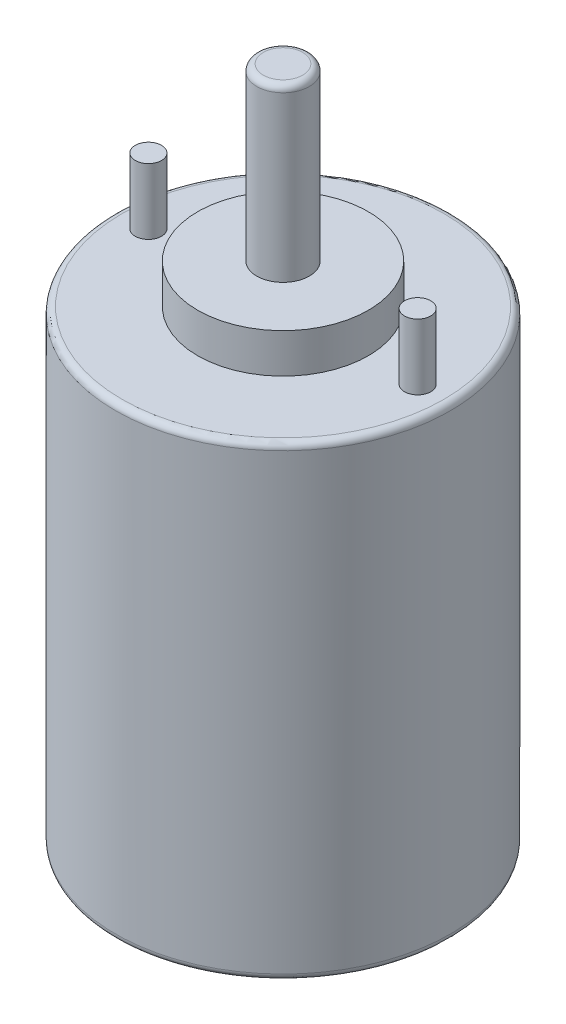
ISO-10303-21;
HEADER;
FILE_DESCRIPTION(('STEP AP214'),'2;1');
FILE_NAME('part.step','',(''),(''),'','','');
FILE_SCHEMA(('AUTOMOTIVE_DESIGN { 1 0 10303 214 1 1 1 1 }'));
ENDSEC;
DATA;
#1=APPLICATION_CONTEXT('core data for automotive mechanical design processes');
#2=APPLICATION_PROTOCOL_DEFINITION('international standard','automotive_design',2000,#1);
#3=PRODUCT_CONTEXT('',#1,'mechanical');
#4=PRODUCT('Part','Part','',(#3));
#5=PRODUCT_RELATED_PRODUCT_CATEGORY('part','',(#4));
#6=PRODUCT_DEFINITION_FORMATION('','',#4);
#7=PRODUCT_DEFINITION_CONTEXT('part definition',#1,'design');
#8=PRODUCT_DEFINITION('design','',#6,#7);
#9=PRODUCT_DEFINITION_SHAPE('','',#8);
#10=(LENGTH_UNIT() NAMED_UNIT(*) SI_UNIT(.MILLI.,.METRE.));
#11=(NAMED_UNIT(*) PLANE_ANGLE_UNIT() SI_UNIT($,.RADIAN.));
#12=(NAMED_UNIT(*) SI_UNIT($,.STERADIAN.) SOLID_ANGLE_UNIT());
#13=UNCERTAINTY_MEASURE_WITH_UNIT(LENGTH_MEASURE(1.E-05),#10,'distance_accuracy_value','');
#14=(GEOMETRIC_REPRESENTATION_CONTEXT(3) GLOBAL_UNCERTAINTY_ASSIGNED_CONTEXT((#13)) GLOBAL_UNIT_ASSIGNED_CONTEXT((#10,
#11,#12)) REPRESENTATION_CONTEXT('',''));
#15=CARTESIAN_POINT('',(0.,0.,0.));
#16=DIRECTION('',(0.,0.,1.));
#17=DIRECTION('',(1.,0.,0.));
#18=AXIS2_PLACEMENT_3D('',#15,#16,#17);
#19=CARTESIAN_POINT('',(0.,32.5,0.));
#20=DIRECTION('',(0.,-1.,0.));
#21=DIRECTION('',(0.,0.,-1.));
#22=AXIS2_PLACEMENT_3D('',#19,#20,#21);
#23=CYLINDRICAL_SURFACE('',#22,25.5);
#24=CARTESIAN_POINT('',(0.,-34.5,0.));
#25=DIRECTION('',(0.,-1.,0.));
#26=DIRECTION('',(0.,0.,-1.));
#27=AXIS2_PLACEMENT_3D('',#24,#25,#26);
#28=CIRCLE('',#27,25.5);
#29=CARTESIAN_POINT('',(0.,-34.5,-25.5));
#30=VERTEX_POINT('',#29);
#31=EDGE_CURVE('E63',#30,#30,#28,.F.);
#32=ORIENTED_EDGE('',*,*,#31,.T.);
#33=EDGE_LOOP('',(#32));
#34=FACE_BOUND('',#33,.T.);
#35=CARTESIAN_POINT('',(0.,34.5,0.));
#36=DIRECTION('',(0.,1.,0.));
#37=DIRECTION('',(0.,0.,1.));
#38=AXIS2_PLACEMENT_3D('',#35,#36,#37);
#39=CIRCLE('',#38,25.5);
#40=CARTESIAN_POINT('',(0.,34.5,25.5));
#41=VERTEX_POINT('',#40);
#42=EDGE_CURVE('E66',#41,#41,#39,.F.);
#43=ORIENTED_EDGE('',*,*,#42,.T.);
#44=EDGE_LOOP('',(#43));
#45=FACE_BOUND('',#44,.T.);
#46=ADVANCED_FACE('F40',(#34,#45),#23,.T.);
#47=CARTESIAN_POINT('',(0.,35.5,0.));
#48=DIRECTION('',(0.,1.,0.));
#49=DIRECTION('',(0.,0.,1.));
#50=AXIS2_PLACEMENT_3D('',#47,#48,#49);
#51=PLANE('',#50);
#52=CARTESIAN_POINT('',(20.5,35.5,0.));
#53=DIRECTION('',(0.,1.,0.));
#54=DIRECTION('',(0.,0.,1.));
#55=AXIS2_PLACEMENT_3D('',#52,#53,#54);
#56=CIRCLE('',#55,2.);
#57=CARTESIAN_POINT('',(20.5,35.5,2.));
#58=VERTEX_POINT('',#57);
#59=EDGE_CURVE('E88',#58,#58,#56,.T.);
#60=ORIENTED_EDGE('',*,*,#59,.F.);
#61=EDGE_LOOP('',(#60));
#62=FACE_BOUND('',#61,.T.);
#63=CARTESIAN_POINT('',(-20.5,35.5,0.));
#64=DIRECTION('',(0.,1.,0.));
#65=DIRECTION('',(0.,0.,1.));
#66=AXIS2_PLACEMENT_3D('',#63,#64,#65);
#67=CIRCLE('',#66,2.);
#68=CARTESIAN_POINT('',(-20.5,35.5,2.));
#69=VERTEX_POINT('',#68);
#70=EDGE_CURVE('E82',#69,#69,#67,.T.);
#71=ORIENTED_EDGE('',*,*,#70,.F.);
#72=EDGE_LOOP('',(#71));
#73=FACE_BOUND('',#72,.T.);
#74=CARTESIAN_POINT('',(0.,35.5,0.));
#75=DIRECTION('',(0.,1.,0.));
#76=DIRECTION('',(0.,0.,1.));
#77=AXIS2_PLACEMENT_3D('',#74,#75,#76);
#78=CIRCLE('',#77,13.);
#79=CARTESIAN_POINT('',(0.,35.5,13.));
#80=VERTEX_POINT('',#79);
#81=EDGE_CURVE('E73',#80,#80,#78,.T.);
#82=ORIENTED_EDGE('',*,*,#81,.F.);
#83=EDGE_LOOP('',(#82));
#84=FACE_BOUND('',#83,.T.);
#85=CARTESIAN_POINT('',(0.,35.5,0.));
#86=DIRECTION('',(0.,1.,0.));
#87=DIRECTION('',(0.,0.,1.));
#88=AXIS2_PLACEMENT_3D('',#85,#86,#87);
#89=CIRCLE('',#88,24.5);
#90=CARTESIAN_POINT('',(0.,35.5,24.5));
#91=VERTEX_POINT('',#90);
#92=EDGE_CURVE('E69',#91,#91,#89,.T.);
#93=ORIENTED_EDGE('',*,*,#92,.T.);
#94=EDGE_LOOP('',(#93));
#95=FACE_BOUND('',#94,.T.);
#96=ADVANCED_FACE('F103',(#62,#73,#84,#95),#51,.T.);
#97=CARTESIAN_POINT('',(0.,34.5,0.));
#98=DIRECTION('',(0.,1.,0.));
#99=DIRECTION('',(0.,0.,1.));
#100=AXIS2_PLACEMENT_3D('',#97,#98,#99);
#101=TOROIDAL_SURFACE('',#100,24.5,1.);
#102=ORIENTED_EDGE('',*,*,#42,.F.);
#103=EDGE_LOOP('',(#102));
#104=FACE_BOUND('',#103,.T.);
#105=ORIENTED_EDGE('',*,*,#92,.F.);
#106=EDGE_LOOP('',(#105));
#107=FACE_BOUND('',#106,.T.);
#108=ADVANCED_FACE('F106',(#104,#107),#101,.T.);
#109=CARTESIAN_POINT('',(0.,41.5,0.));
#110=DIRECTION('',(0.,-1.,0.));
#111=DIRECTION('',(0.,0.,-1.));
#112=AXIS2_PLACEMENT_3D('',#109,#110,#111);
#113=CYLINDRICAL_SURFACE('',#112,13.);
#114=CARTESIAN_POINT('',(0.,41.5,0.));
#115=DIRECTION('',(0.,1.,0.));
#116=DIRECTION('',(0.,0.,1.));
#117=AXIS2_PLACEMENT_3D('',#114,#115,#116);
#118=CIRCLE('',#117,13.);
#119=CARTESIAN_POINT('',(0.,41.5,13.));
#120=VERTEX_POINT('',#119);
#121=EDGE_CURVE('E72',#120,#120,#118,.T.);
#122=ORIENTED_EDGE('',*,*,#121,.F.);
#123=EDGE_LOOP('',(#122));
#124=FACE_BOUND('',#123,.T.);
#125=ORIENTED_EDGE('',*,*,#81,.T.);
#126=EDGE_LOOP('',(#125));
#127=FACE_BOUND('',#126,.T.);
#128=ADVANCED_FACE('F115',(#124,#127),#113,.T.);
#129=CARTESIAN_POINT('',(0.,41.5,0.));
#130=DIRECTION('',(0.,1.,0.));
#131=DIRECTION('',(0.,0.,1.));
#132=AXIS2_PLACEMENT_3D('',#129,#130,#131);
#133=PLANE('',#132);
#134=CARTESIAN_POINT('',(0.,41.5,0.));
#135=DIRECTION('',(0.,1.,0.));
#136=DIRECTION('',(0.,0.,1.));
#137=AXIS2_PLACEMENT_3D('',#134,#135,#136);
#138=CIRCLE('',#137,4.);
#139=CARTESIAN_POINT('',(0.,41.5,4.));
#140=VERTEX_POINT('',#139);
#141=EDGE_CURVE('E51',#140,#140,#138,.T.);
#142=ORIENTED_EDGE('',*,*,#141,.F.);
#143=EDGE_LOOP('',(#142));
#144=FACE_BOUND('',#143,.T.);
#145=ORIENTED_EDGE('',*,*,#121,.T.);
#146=EDGE_LOOP('',(#145));
#147=FACE_BOUND('',#146,.T.);
#148=ADVANCED_FACE('F121',(#144,#147),#133,.T.);
#149=CARTESIAN_POINT('',(0.,-35.5,0.));
#150=DIRECTION('',(0.,-1.,0.));
#151=DIRECTION('',(0.,0.,1.));
#152=AXIS2_PLACEMENT_3D('',#149,#150,#151);
#153=PLANE('',#152);
#154=CARTESIAN_POINT('',(0.,-35.5,0.));
#155=DIRECTION('',(0.,-1.,0.));
#156=DIRECTION('',(0.,0.,-1.));
#157=AXIS2_PLACEMENT_3D('',#154,#155,#156);
#158=CIRCLE('',#157,13.);
#159=CARTESIAN_POINT('',(0.,-35.5,-13.));
#160=VERTEX_POINT('',#159);
#161=EDGE_CURVE('E55',#160,#160,#158,.T.);
#162=ORIENTED_EDGE('',*,*,#161,.F.);
#163=EDGE_LOOP('',(#162));
#164=FACE_BOUND('',#163,.T.);
#165=CARTESIAN_POINT('',(0.,-35.5,0.));
#166=DIRECTION('',(0.,-1.,0.));
#167=DIRECTION('',(0.,0.,-1.));
#168=AXIS2_PLACEMENT_3D('',#165,#166,#167);
#169=CIRCLE('',#168,24.5);
#170=CARTESIAN_POINT('',(0.,-35.5,-24.5));
#171=VERTEX_POINT('',#170);
#172=EDGE_CURVE('E60',#171,#171,#169,.T.);
#173=ORIENTED_EDGE('',*,*,#172,.T.);
#174=EDGE_LOOP('',(#173));
#175=FACE_BOUND('',#174,.T.);
#176=ADVANCED_FACE('F134',(#164,#175),#153,.T.);
#177=CARTESIAN_POINT('',(0.,-34.5,0.));
#178=DIRECTION('',(0.,-1.,0.));
#179=DIRECTION('',(0.,0.,-1.));
#180=AXIS2_PLACEMENT_3D('',#177,#178,#179);
#181=TOROIDAL_SURFACE('',#180,24.5,1.);
#182=ORIENTED_EDGE('',*,*,#172,.F.);
#183=EDGE_LOOP('',(#182));
#184=FACE_BOUND('',#183,.T.);
#185=ORIENTED_EDGE('',*,*,#31,.F.);
#186=EDGE_LOOP('',(#185));
#187=FACE_BOUND('',#186,.T.);
#188=ADVANCED_FACE('F138',(#184,#187),#181,.T.);
#189=CARTESIAN_POINT('',(0.,-41.5,0.));
#190=DIRECTION('',(0.,1.,0.));
#191=DIRECTION('',(0.,0.,1.));
#192=AXIS2_PLACEMENT_3D('',#189,#190,#191);
#193=CYLINDRICAL_SURFACE('',#192,13.);
#194=CARTESIAN_POINT('',(0.,-41.5,0.));
#195=DIRECTION('',(0.,1.,0.));
#196=DIRECTION('',(0.,0.,1.));
#197=AXIS2_PLACEMENT_3D('',#194,#195,#196);
#198=CIRCLE('',#197,13.);
#199=CARTESIAN_POINT('',(0.,-41.5,13.));
#200=VERTEX_POINT('',#199);
#201=EDGE_CURVE('E76',#200,#200,#198,.T.);
#202=ORIENTED_EDGE('',*,*,#201,.T.);
#203=EDGE_LOOP('',(#202));
#204=FACE_BOUND('',#203,.T.);
#205=ORIENTED_EDGE('',*,*,#161,.T.);
#206=EDGE_LOOP('',(#205));
#207=FACE_BOUND('',#206,.T.);
#208=ADVANCED_FACE('F140',(#204,#207),#193,.T.);
#209=CARTESIAN_POINT('',(0.,-41.5,0.));
#210=DIRECTION('',(0.,-1.,0.));
#211=DIRECTION('',(0.,0.,1.));
#212=AXIS2_PLACEMENT_3D('',#209,#210,#211);
#213=PLANE('',#212);
#214=ORIENTED_EDGE('',*,*,#201,.F.);
#215=EDGE_LOOP('',(#214));
#216=FACE_BOUND('',#215,.T.);
#217=ADVANCED_FACE('F143',(#216),#213,.T.);
#218=CARTESIAN_POINT('',(0.,67.5,0.));
#219=DIRECTION('',(0.,-1.,0.));
#220=DIRECTION('',(0.,0.,-1.));
#221=AXIS2_PLACEMENT_3D('',#218,#219,#220);
#222=CYLINDRICAL_SURFACE('',#221,4.);
#223=CARTESIAN_POINT('',(0.,66.5,0.));
#224=DIRECTION('',(0.,1.,0.));
#225=DIRECTION('',(0.,0.,1.));
#226=AXIS2_PLACEMENT_3D('',#223,#224,#225);
#227=CIRCLE('',#226,4.);
#228=CARTESIAN_POINT('',(0.,66.5,4.));
#229=VERTEX_POINT('',#228);
#230=EDGE_CURVE('E10',#229,#229,#227,.F.);
#231=ORIENTED_EDGE('',*,*,#230,.T.);
#232=EDGE_LOOP('',(#231));
#233=FACE_BOUND('',#232,.T.);
#234=ORIENTED_EDGE('',*,*,#141,.T.);
#235=EDGE_LOOP('',(#234));
#236=FACE_BOUND('',#235,.T.);
#237=ADVANCED_FACE('F147',(#233,#236),#222,.T.);
#238=CARTESIAN_POINT('',(0.,67.5,0.));
#239=DIRECTION('',(0.,1.,0.));
#240=DIRECTION('',(0.,0.,1.));
#241=AXIS2_PLACEMENT_3D('',#238,#239,#240);
#242=PLANE('',#241);
#243=CARTESIAN_POINT('',(0.,67.5,0.));
#244=DIRECTION('',(0.,1.,0.));
#245=DIRECTION('',(0.,0.,1.));
#246=AXIS2_PLACEMENT_3D('',#243,#244,#245);
#247=CIRCLE('',#246,3.);
#248=CARTESIAN_POINT('',(0.,67.5,3.));
#249=VERTEX_POINT('',#248);
#250=EDGE_CURVE('E47',#249,#249,#247,.T.);
#251=ORIENTED_EDGE('',*,*,#250,.T.);
#252=EDGE_LOOP('',(#251));
#253=FACE_BOUND('',#252,.T.);
#254=ADVANCED_FACE('F151',(#253),#242,.T.);
#255=CARTESIAN_POINT('',(-20.5,45.5,0.));
#256=DIRECTION('',(0.,-1.,0.));
#257=DIRECTION('',(0.,0.,-1.));
#258=AXIS2_PLACEMENT_3D('',#255,#256,#257);
#259=CYLINDRICAL_SURFACE('',#258,2.);
#260=CARTESIAN_POINT('',(-20.5,45.5,0.));
#261=DIRECTION('',(0.,1.,0.));
#262=DIRECTION('',(0.,0.,1.));
#263=AXIS2_PLACEMENT_3D('',#260,#261,#262);
#264=CIRCLE('',#263,2.);
#265=CARTESIAN_POINT('',(-20.5,45.5,2.));
#266=VERTEX_POINT('',#265);
#267=EDGE_CURVE('E80',#266,#266,#264,.T.);
#268=ORIENTED_EDGE('',*,*,#267,.F.);
#269=EDGE_LOOP('',(#268));
#270=FACE_BOUND('',#269,.T.);
#271=ORIENTED_EDGE('',*,*,#70,.T.);
#272=EDGE_LOOP('',(#271));
#273=FACE_BOUND('',#272,.T.);
#274=ADVANCED_FACE('F154',(#270,#273),#259,.T.);
#275=CARTESIAN_POINT('',(-20.5,45.5,0.));
#276=DIRECTION('',(0.,1.,0.));
#277=DIRECTION('',(0.,0.,1.));
#278=AXIS2_PLACEMENT_3D('',#275,#276,#277);
#279=PLANE('',#278);
#280=ORIENTED_EDGE('',*,*,#267,.T.);
#281=EDGE_LOOP('',(#280));
#282=FACE_BOUND('',#281,.T.);
#283=ADVANCED_FACE('F99',(#282),#279,.T.);
#284=CARTESIAN_POINT('',(20.5,45.5,0.));
#285=DIRECTION('',(0.,-1.,0.));
#286=DIRECTION('',(0.,0.,-1.));
#287=AXIS2_PLACEMENT_3D('',#284,#285,#286);
#288=CYLINDRICAL_SURFACE('',#287,2.);
#289=CARTESIAN_POINT('',(20.5,45.5,0.));
#290=DIRECTION('',(0.,1.,0.));
#291=DIRECTION('',(0.,0.,1.));
#292=AXIS2_PLACEMENT_3D('',#289,#290,#291);
#293=CIRCLE('',#292,2.);
#294=CARTESIAN_POINT('',(20.5,45.5,2.));
#295=VERTEX_POINT('',#294);
#296=EDGE_CURVE('E85',#295,#295,#293,.T.);
#297=ORIENTED_EDGE('',*,*,#296,.F.);
#298=EDGE_LOOP('',(#297));
#299=FACE_BOUND('',#298,.T.);
#300=ORIENTED_EDGE('',*,*,#59,.T.);
#301=EDGE_LOOP('',(#300));
#302=FACE_BOUND('',#301,.T.);
#303=ADVANCED_FACE('F96',(#299,#302),#288,.T.);
#304=CARTESIAN_POINT('',(20.5,45.5,0.));
#305=DIRECTION('',(0.,1.,0.));
#306=DIRECTION('',(0.,0.,1.));
#307=AXIS2_PLACEMENT_3D('',#304,#305,#306);
#308=PLANE('',#307);
#309=ORIENTED_EDGE('',*,*,#296,.T.);
#310=EDGE_LOOP('',(#309));
#311=FACE_BOUND('',#310,.T.);
#312=ADVANCED_FACE('F94',(#311),#308,.T.);
#313=CARTESIAN_POINT('',(0.,66.5,0.));
#314=DIRECTION('',(0.,1.,0.));
#315=DIRECTION('',(0.,0.,1.));
#316=AXIS2_PLACEMENT_3D('',#313,#314,#315);
#317=TOROIDAL_SURFACE('',#316,3.,1.);
#318=ORIENTED_EDGE('',*,*,#230,.F.);
#319=EDGE_LOOP('',(#318));
#320=FACE_BOUND('',#319,.T.);
#321=ORIENTED_EDGE('',*,*,#250,.F.);
#322=EDGE_LOOP('',(#321));
#323=FACE_BOUND('',#322,.T.);
#324=ADVANCED_FACE('F42',(#320,#323),#317,.T.);
#325=CLOSED_SHELL('',(#46,#96,#108,#128,#148,#176,#188,#208,#217,#237,#254,#274,#283,#303,#312,#324));
#326=MANIFOLD_SOLID_BREP('B2',#325);
#327=ADVANCED_BREP_SHAPE_REPRESENTATION('',(#18,#326),#14);
#328=SHAPE_DEFINITION_REPRESENTATION(#9,#327);
ENDSEC;
END-ISO-10303-21;
